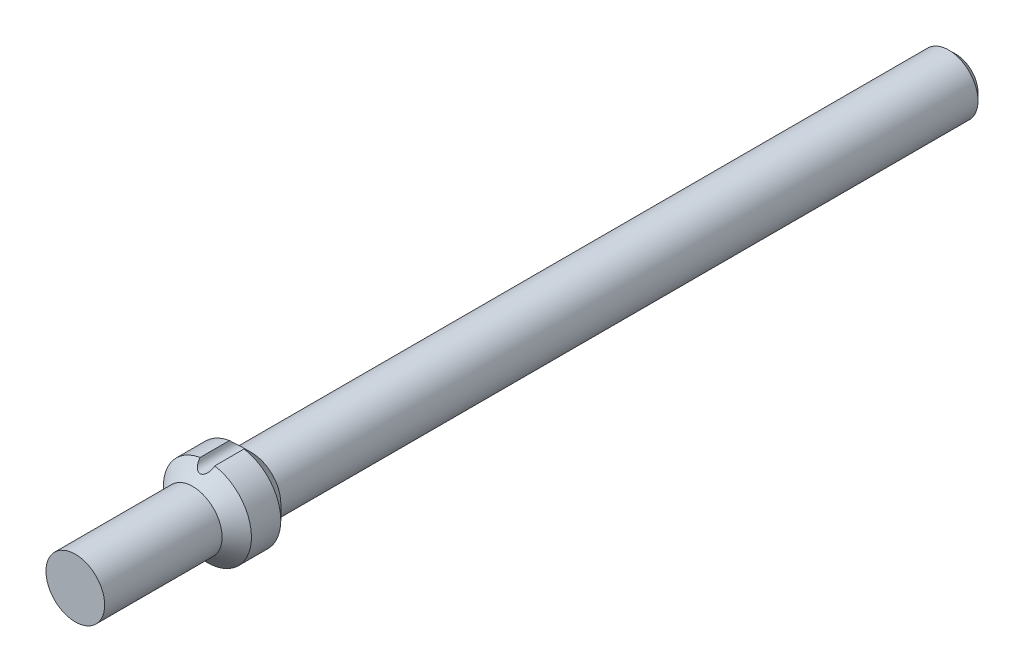
ISO-10303-21;
HEADER;
FILE_DESCRIPTION(('STEP AP214'),'2;1');
FILE_NAME('part.step','',(''),(''),'','','');
FILE_SCHEMA(('AUTOMOTIVE_DESIGN { 1 0 10303 214 1 1 1 1 }'));
ENDSEC;
DATA;
#1=APPLICATION_CONTEXT('core data for automotive mechanical design processes');
#2=APPLICATION_PROTOCOL_DEFINITION('international standard','automotive_design',2000,#1);
#3=PRODUCT_CONTEXT('',#1,'mechanical');
#4=PRODUCT('Part','Part','',(#3));
#5=PRODUCT_RELATED_PRODUCT_CATEGORY('part','',(#4));
#6=PRODUCT_DEFINITION_FORMATION('','',#4);
#7=PRODUCT_DEFINITION_CONTEXT('part definition',#1,'design');
#8=PRODUCT_DEFINITION('design','',#6,#7);
#9=PRODUCT_DEFINITION_SHAPE('','',#8);
#10=(LENGTH_UNIT() NAMED_UNIT(*) SI_UNIT(.MILLI.,.METRE.));
#11=(NAMED_UNIT(*) PLANE_ANGLE_UNIT() SI_UNIT($,.RADIAN.));
#12=(NAMED_UNIT(*) SI_UNIT($,.STERADIAN.) SOLID_ANGLE_UNIT());
#13=UNCERTAINTY_MEASURE_WITH_UNIT(LENGTH_MEASURE(1.E-05),#10,'distance_accuracy_value','');
#14=(GEOMETRIC_REPRESENTATION_CONTEXT(3) GLOBAL_UNCERTAINTY_ASSIGNED_CONTEXT((#13)) GLOBAL_UNIT_ASSIGNED_CONTEXT((#10,
#11,#12)) REPRESENTATION_CONTEXT('',''));
#15=CARTESIAN_POINT('',(0.,0.,0.));
#16=DIRECTION('',(0.,0.,1.));
#17=DIRECTION('',(1.,0.,0.));
#18=AXIS2_PLACEMENT_3D('',#15,#16,#17);
#19=CARTESIAN_POINT('',(0.,0.,190.5));
#20=DIRECTION('',(0.,0.,1.));
#21=DIRECTION('',(1.,0.,0.));
#22=AXIS2_PLACEMENT_3D('',#19,#20,#21);
#23=PLANE('',#22);
#24=CARTESIAN_POINT('',(0.,0.,190.5));
#25=DIRECTION('',(0.,0.,1.));
#26=DIRECTION('',(1.,0.,0.));
#27=AXIS2_PLACEMENT_3D('',#24,#25,#26);
#28=CIRCLE('',#27,12.7);
#29=CARTESIAN_POINT('',(12.7,0.,190.5));
#30=VERTEX_POINT('',#29);
#31=EDGE_CURVE('E45',#30,#30,#28,.T.);
#32=ORIENTED_EDGE('',*,*,#31,.T.);
#33=EDGE_LOOP('',(#32));
#34=FACE_BOUND('',#33,.T.);
#35=ADVANCED_FACE('F33',(#34),#23,.T.);
#36=CARTESIAN_POINT('',(0.,0.,190.5));
#37=DIRECTION('',(0.,0.,1.));
#38=DIRECTION('',(1.,0.,0.));
#39=AXIS2_PLACEMENT_3D('',#36,#37,#38);
#40=CYLINDRICAL_SURFACE('',#39,12.7);
#41=CARTESIAN_POINT('',(0.,0.,139.7));
#42=DIRECTION('',(0.,0.,1.));
#43=DIRECTION('',(1.,0.,0.));
#44=AXIS2_PLACEMENT_3D('',#41,#42,#43);
#45=CIRCLE('',#44,12.7);
#46=CARTESIAN_POINT('',(12.7,0.,139.7));
#47=VERTEX_POINT('',#46);
#48=EDGE_CURVE('E78',#47,#47,#45,.T.);
#49=ORIENTED_EDGE('',*,*,#48,.T.);
#50=EDGE_LOOP('',(#49));
#51=FACE_BOUND('',#50,.T.);
#52=ORIENTED_EDGE('',*,*,#31,.F.);
#53=EDGE_LOOP('',(#52));
#54=FACE_BOUND('',#53,.T.);
#55=ADVANCED_FACE('F90',(#51,#54),#40,.T.);
#56=CARTESIAN_POINT('',(0.,0.,139.7));
#57=DIRECTION('',(0.,0.,-1.));
#58=DIRECTION('',(-1.,0.,0.));
#59=AXIS2_PLACEMENT_3D('',#56,#57,#58);
#60=CONICAL_SURFACE('',#59,12.7,0.785398163397451);
#61=CARTESIAN_POINT('',(-3.16397320684149,18.7856166677167,133.3498));
#62=CARTESIAN_POINT('',(-3.15362841576084,18.6622783694114,133.473125277718));
#63=CARTESIAN_POINT('',(-3.13617180969332,18.5398462577629,133.596765176599));
#64=CARTESIAN_POINT('',(-3.08702145950594,18.2974717884602,133.84395037006));
#65=CARTESIAN_POINT('',(-3.0553105890041,18.1775326079449,133.967495371225));
#66=CARTESIAN_POINT('',(-2.97725815191958,17.9398893464153,134.214748623002));
#67=CARTESIAN_POINT('',(-2.93076740058799,17.8222216373548,134.33844513021));
#68=CARTESIAN_POINT('',(-2.82303820572173,17.5914758759735,134.583480082736));
#69=CARTESIAN_POINT('',(-2.76180883776136,17.4783950490735,134.704819929712));
#70=CARTESIAN_POINT('',(-2.59842320650613,17.2167915412879,134.988377326828));
#71=CARTESIAN_POINT('',(-2.4895095997699,17.0706722279691,135.149071604418));
#72=CARTESIAN_POINT('',(-2.30317028456942,16.8626158885982,135.380898730797));
#73=CARTESIAN_POINT('',(-2.23732435111494,16.7951938899621,135.45655105798));
#74=CARTESIAN_POINT('',(-2.09756964863938,16.66463434473,135.60398523122));
#75=CARTESIAN_POINT('',(-2.02366378944221,16.6014952651643,135.67576846022));
#76=CARTESIAN_POINT('',(-1.83674996150099,16.4565589370775,135.841549097078));
#77=CARTESIAN_POINT('',(-1.71976604721775,16.3771423745608,135.933232264957));
#78=CARTESIAN_POINT('',(-1.46872714450938,16.2314086969568,136.102700654801));
#79=CARTESIAN_POINT('',(-1.33469549432503,16.165073983746,136.180504533988));
#80=CARTESIAN_POINT('',(-1.08221240007173,16.062766098244,136.301170420252));
#81=CARTESIAN_POINT('',(-0.967070064671861,16.0233194684335,136.347955448235));
#82=CARTESIAN_POINT('',(-0.728290689593079,15.9571828409747,136.426636264636));
#83=CARTESIAN_POINT('',(-0.604661349958688,15.930481450372,136.458545350044));
#84=CARTESIAN_POINT('',(-0.350802239237976,15.8918127686385,136.504819779451));
#85=CARTESIAN_POINT('',(-0.220528820417465,15.879961011551,136.51904755131));
#86=CARTESIAN_POINT('',(0.0411321966811735,15.872573599013,136.527911061836));
#87=CARTESIAN_POINT('',(0.17251932222071,15.8770313357765,136.522554734994));
#88=CARTESIAN_POINT('',(0.416348024454796,15.9003145820964,136.494646947996));
#89=CARTESIAN_POINT('',(0.529210311313943,15.9174014959229,136.474176504411));
#90=CARTESIAN_POINT('',(0.749399712760925,15.9626582774062,136.42013349011));
#91=CARTESIAN_POINT('',(0.856724180410162,15.9908333904436,136.386554718433));
#92=CARTESIAN_POINT('',(1.10355527437647,16.0691744961836,136.293586922755));
#93=CARTESIAN_POINT('',(1.23982725531292,16.1236281277085,136.229238992238));
#94=CARTESIAN_POINT('',(1.49706867313834,16.2464590386126,136.085177402512));
#95=CARTESIAN_POINT('',(1.61800515070064,16.3148655098767,136.005431547011));
#96=CARTESIAN_POINT('',(1.89594346752594,16.4956723523005,135.796434095507));
#97=CARTESIAN_POINT('',(2.04453661309622,16.6139816582858,135.661099051541));
#98=CARTESIAN_POINT('',(2.24499521275209,16.8029845864911,135.447802092503));
#99=CARTESIAN_POINT('',(2.30815650129856,16.8680183442118,135.374866495132));
#100=CARTESIAN_POINT('',(2.42733122710855,17.0014195209502,135.226249526947));
#101=CARTESIAN_POINT('',(2.48334634905286,17.0697861489847,135.150568808708));
#102=CARTESIAN_POINT('',(2.60984444246093,17.2376989695623,134.965950578604));
#103=CARTESIAN_POINT('',(2.67697544606644,17.3386405833222,134.855978995291));
#104=CARTESIAN_POINT('',(2.79825010277812,17.5450874761338,134.633221266065));
#105=CARTESIAN_POINT('',(2.85238734092037,17.650594979131,134.520433760154));
#106=CARTESIAN_POINT('',(2.9957775631146,17.9724695342846,134.179669651793));
#107=CARTESIAN_POINT('',(3.06631334359292,18.1946046621256,133.948832872652));
#108=CARTESIAN_POINT('',(3.12424198725933,18.4812203683463,133.656561955469));
#109=CARTESIAN_POINT('',(3.13466704601658,18.5417995021738,133.595093884753));
#110=CARTESIAN_POINT('',(3.15196863515888,18.6633754626354,133.472336199684));
#111=CARTESIAN_POINT('',(3.15885276382486,18.7243711078847,133.411046486208));
#112=CARTESIAN_POINT('',(3.16397320684147,18.7856166677166,133.3498));
#113=B_SPLINE_CURVE_WITH_KNOTS('',3,(#61,#62,#63,#64,#65,#66,#67,#68,#69,#70,#71,#72,#73,#74,
#75,#76,#77,#78,#79,#80,#81,#82,#83,#84,#85,#86,#87,#88,#89,#90,#91,#92,#93,#94,#95,#96,#97,#98,
#99,#100,#101,#102,#103,#104,#105,#106,#107,#108,#109,#110,#111,#112),.UNSPECIFIED.,.F.,.F.,(4,
2,2,2,2,2,2,2,2,2,2,2,2,2,2,2,2,2,2,2,2,2,2,2,2,4),(0.,0.524026774253611,1.04868485229632,
1.57881647568533,2.1086224921059,2.83485240649359,3.19707481068595,3.55916687423703,
4.06311075395359,4.56637201722548,4.95607048254869,5.34541994146088,5.73778020190183,
6.12998151532194,6.47638322568381,6.82294900210861,7.30097230933135,7.78000618039217,
8.47557925636183,8.82444718899278,9.17323272479514,9.66354200677281,10.1540928566231,
11.1331478923163,11.393906532042,11.6541032654407),.UNSPECIFIED.);
#114=CARTESIAN_POINT('',(-3.16395648827892,18.7854166666667,133.35));
#115=VERTEX_POINT('',#114);
#116=CARTESIAN_POINT('',(3.1639564882789,18.7854166666667,133.35));
#117=VERTEX_POINT('',#116);
#118=EDGE_CURVE('E72',#115,#117,#113,.T.);
#119=ORIENTED_EDGE('',*,*,#118,.F.);
#120=CARTESIAN_POINT('',(0.,0.,133.35));
#121=DIRECTION('',(0.,0.,1.));
#122=DIRECTION('',(1.,0.,0.));
#123=AXIS2_PLACEMENT_3D('',#120,#121,#122);
#124=CIRCLE('',#123,19.05);
#125=EDGE_CURVE('E70',#115,#117,#124,.T.);
#126=ORIENTED_EDGE('',*,*,#125,.T.);
#127=EDGE_LOOP('',(#119,#126));
#128=FACE_BOUND('',#127,.T.);
#129=ORIENTED_EDGE('',*,*,#48,.F.);
#130=EDGE_LOOP('',(#129));
#131=FACE_BOUND('',#130,.T.);
#132=ADVANCED_FACE('F92',(#128,#131),#60,.T.);
#133=CARTESIAN_POINT('',(0.,0.,190.5));
#134=DIRECTION('',(0.,0.,1.));
#135=DIRECTION('',(1.,0.,0.));
#136=AXIS2_PLACEMENT_3D('',#133,#134,#135);
#137=CYLINDRICAL_SURFACE('',#136,19.05);
#138=DIRECTION('',(0.,0.,1.));
#139=VECTOR('',#138,1.);
#140=CARTESIAN_POINT('',(-3.16395648827892,18.7854166666667,153.763112725722));
#141=LINE('',#140,#139);
#142=CARTESIAN_POINT('',(-3.16395648827892,18.7854166666667,120.65));
#143=VERTEX_POINT('',#142);
#144=EDGE_CURVE('E56',#143,#115,#141,.T.);
#145=ORIENTED_EDGE('',*,*,#144,.F.);
#146=CARTESIAN_POINT('',(0.,0.,120.65));
#147=DIRECTION('',(0.,0.,1.));
#148=DIRECTION('',(1.,0.,0.));
#149=AXIS2_PLACEMENT_3D('',#146,#147,#148);
#150=CIRCLE('',#149,19.05);
#151=CARTESIAN_POINT('',(3.1639564882789,18.7854166666667,120.65));
#152=VERTEX_POINT('',#151);
#153=EDGE_CURVE('E68',#143,#152,#150,.T.);
#154=ORIENTED_EDGE('',*,*,#153,.T.);
#155=DIRECTION('',(0.,0.,1.));
#156=VECTOR('',#155,1.);
#157=CARTESIAN_POINT('',(3.1639564882789,18.7854166666667,153.763112725722));
#158=LINE('',#157,#156);
#159=EDGE_CURVE('E51',#117,#152,#158,.F.);
#160=ORIENTED_EDGE('',*,*,#159,.F.);
#161=ORIENTED_EDGE('',*,*,#125,.F.);
#162=EDGE_LOOP('',(#145,#154,#160,#161));
#163=FACE_BOUND('',#162,.T.);
#164=ADVANCED_FACE('F67',(#163),#137,.T.);
#165=CARTESIAN_POINT('',(0.,0.,120.65));
#166=DIRECTION('',(0.,0.,1.));
#167=DIRECTION('',(1.,0.,0.));
#168=AXIS2_PLACEMENT_3D('',#165,#166,#167);
#169=CONICAL_SURFACE('',#168,19.05,0.785398163397453);
#170=CARTESIAN_POINT('',(3.16397320684147,18.7856166677167,120.6502));
#171=CARTESIAN_POINT('',(3.15362841576082,18.6622783694114,120.526874722282));
#172=CARTESIAN_POINT('',(3.1361718096933,18.5398462577629,120.403234823401));
#173=CARTESIAN_POINT('',(3.08702145950592,18.2974717884602,120.15604962994));
#174=CARTESIAN_POINT('',(3.05531058900408,18.177532607945,120.032504628775));
#175=CARTESIAN_POINT('',(2.97725815191956,17.9398893464153,119.785251376998));
#176=CARTESIAN_POINT('',(2.93076740058797,17.8222216373548,119.66155486979));
#177=CARTESIAN_POINT('',(2.82303820572171,17.5914758759735,119.416519917264));
#178=CARTESIAN_POINT('',(2.76180883776135,17.4783950490735,119.295180070288));
#179=CARTESIAN_POINT('',(2.59842320650611,17.2167915412879,119.011622673172));
#180=CARTESIAN_POINT('',(2.48950959976989,17.0706722279691,118.850928395582));
#181=CARTESIAN_POINT('',(2.3031702845694,16.8626158885982,118.619101269203));
#182=CARTESIAN_POINT('',(2.23732435111492,16.7951938899621,118.54344894202));
#183=CARTESIAN_POINT('',(2.09756964863936,16.66463434473,118.39601476878));
#184=CARTESIAN_POINT('',(2.02366378944219,16.6014952651643,118.32423153978));
#185=CARTESIAN_POINT('',(1.83674996150098,16.4565589370775,118.158450902922));
#186=CARTESIAN_POINT('',(1.71976604721773,16.3771423745608,118.066767735043));
#187=CARTESIAN_POINT('',(1.46872714450936,16.2314086969568,117.897299345199));
#188=CARTESIAN_POINT('',(1.33469549432502,16.165073983746,117.819495466012));
#189=CARTESIAN_POINT('',(1.08221240007172,16.062766098244,117.698829579748));
#190=CARTESIAN_POINT('',(0.967070064671844,16.0233194684335,117.652044551765));
#191=CARTESIAN_POINT('',(0.728290689593058,15.9571828409747,117.573363735364));
#192=CARTESIAN_POINT('',(0.604661349958668,15.930481450372,117.541454649957));
#193=CARTESIAN_POINT('',(0.350802239237959,15.8918127686385,117.495180220549));
#194=CARTESIAN_POINT('',(0.220528820417448,15.879961011551,117.48095244869));
#195=CARTESIAN_POINT('',(-0.0411321966811902,15.872573599013,117.472088938164));
#196=CARTESIAN_POINT('',(-0.172519322220726,15.8770313357765,117.477445265006));
#197=CARTESIAN_POINT('',(-0.416348024454816,15.9003145820964,117.505353052004));
#198=CARTESIAN_POINT('',(-0.529210311313966,15.9174014959229,117.525823495589));
#199=CARTESIAN_POINT('',(-0.74939971276095,15.9626582774062,117.57986650989));
#200=CARTESIAN_POINT('',(-0.856724180410184,15.9908333904436,117.613445281567));
#201=CARTESIAN_POINT('',(-1.10355527437649,16.0691744961836,117.706413077245));
#202=CARTESIAN_POINT('',(-1.23982725531294,16.1236281277085,117.770761007762));
#203=CARTESIAN_POINT('',(-1.49706867313836,16.2464590386126,117.914822597488));
#204=CARTESIAN_POINT('',(-1.61800515070066,16.3148655098767,117.994568452989));
#205=CARTESIAN_POINT('',(-1.89594346752596,16.4956723523005,118.203565904493));
#206=CARTESIAN_POINT('',(-2.04453661309623,16.6139816582858,118.338900948459));
#207=CARTESIAN_POINT('',(-2.24499521275211,16.8029845864911,118.552197907497));
#208=CARTESIAN_POINT('',(-2.30815650129858,16.8680183442118,118.625133504868));
#209=CARTESIAN_POINT('',(-2.42733122710856,17.0014195209502,118.773750473053));
#210=CARTESIAN_POINT('',(-2.48334634905287,17.0697861489847,118.849431191292));
#211=CARTESIAN_POINT('',(-2.60984444246095,17.2376989695623,119.034049421396));
#212=CARTESIAN_POINT('',(-2.67697544606647,17.3386405833222,119.144021004709));
#213=CARTESIAN_POINT('',(-2.79825010277814,17.5450874761338,119.366778733935));
#214=CARTESIAN_POINT('',(-2.85238734092039,17.650594979131,119.479566239846));
#215=CARTESIAN_POINT('',(-2.99577756311461,17.9724695342846,119.820330348208));
#216=CARTESIAN_POINT('',(-3.06631334359294,18.1946046621255,120.051167127348));
#217=CARTESIAN_POINT('',(-3.12424198725935,18.4812203683463,120.343438044531));
#218=CARTESIAN_POINT('',(-3.1346670460166,18.5417995021738,120.404906115247));
#219=CARTESIAN_POINT('',(-3.1519686351589,18.6633754626353,120.527663800316));
#220=CARTESIAN_POINT('',(-3.15885276382488,18.7243711078847,120.588953513792));
#221=CARTESIAN_POINT('',(-3.16397320684149,18.7856166677167,120.6502));
#222=B_SPLINE_CURVE_WITH_KNOTS('',3,(#170,#171,#172,#173,#174,#175,#176,#177,#178,#179,#180,
#181,#182,#183,#184,#185,#186,#187,#188,#189,#190,#191,#192,#193,#194,#195,#196,#197,#198,#199,
#200,#201,#202,#203,#204,#205,#206,#207,#208,#209,#210,#211,#212,#213,#214,#215,#216,#217,#218,
#219,#220,#221),.UNSPECIFIED.,.F.,.F.,(4,2,2,2,2,2,2,2,2,2,2,2,2,2,2,2,2,2,2,2,2,2,2,2,2,4),(0.,
0.524026774253591,1.0486848522963,1.57881647568532,2.10862249210586,2.83485240649356,
3.19707481068595,3.55916687423701,4.06311075395358,4.56637201722545,4.95607048254868,
5.34541994146087,5.73778020190181,6.12998151532192,6.4763832256838,6.82294900210858,
7.30097230933134,7.78000618039215,8.4755792563618,8.82444718899276,9.17323272479511,
9.6635420067728,10.1540928566231,11.1331478923163,11.3939065320419,11.6541032654407),.UNSPECIFIED.);
#223=EDGE_CURVE('E11',#152,#143,#222,.T.);
#224=ORIENTED_EDGE('',*,*,#223,.F.);
#225=ORIENTED_EDGE('',*,*,#153,.F.);
#226=EDGE_LOOP('',(#224,#225));
#227=FACE_BOUND('',#226,.T.);
#228=CARTESIAN_POINT('',(0.,0.,114.3));
#229=DIRECTION('',(0.,0.,1.));
#230=DIRECTION('',(1.,0.,0.));
#231=AXIS2_PLACEMENT_3D('',#228,#229,#230);
#232=CIRCLE('',#231,12.7);
#233=CARTESIAN_POINT('',(12.7,0.,114.3));
#234=VERTEX_POINT('',#233);
#235=EDGE_CURVE('E76',#234,#234,#232,.T.);
#236=ORIENTED_EDGE('',*,*,#235,.T.);
#237=EDGE_LOOP('',(#236));
#238=FACE_BOUND('',#237,.T.);
#239=ADVANCED_FACE('F74',(#227,#238),#169,.T.);
#240=CARTESIAN_POINT('',(0.,0.,190.5));
#241=DIRECTION('',(0.,0.,1.));
#242=DIRECTION('',(1.,0.,0.));
#243=AXIS2_PLACEMENT_3D('',#240,#241,#242);
#244=CYLINDRICAL_SURFACE('',#243,12.7);
#245=CARTESIAN_POINT('',(0.,0.,-187.325));
#246=DIRECTION('',(0.,0.,1.));
#247=DIRECTION('',(1.,0.,0.));
#248=AXIS2_PLACEMENT_3D('',#245,#246,#247);
#249=CIRCLE('',#248,12.7000000000001);
#250=CARTESIAN_POINT('',(12.7,0.,-187.325));
#251=VERTEX_POINT('',#250);
#252=EDGE_CURVE('E81',#251,#251,#249,.T.);
#253=ORIENTED_EDGE('',*,*,#252,.T.);
#254=EDGE_LOOP('',(#253));
#255=FACE_BOUND('',#254,.T.);
#256=ORIENTED_EDGE('',*,*,#235,.F.);
#257=EDGE_LOOP('',(#256));
#258=FACE_BOUND('',#257,.T.);
#259=ADVANCED_FACE('F119',(#255,#258),#244,.T.);
#260=CARTESIAN_POINT('',(0.,0.,-187.325));
#261=DIRECTION('',(0.,0.,1.));
#262=DIRECTION('',(1.,0.,0.));
#263=AXIS2_PLACEMENT_3D('',#260,#261,#262);
#264=CONICAL_SURFACE('',#263,12.7000000000001,0.785398163397453);
#265=CARTESIAN_POINT('',(0.,0.,-190.5));
#266=DIRECTION('',(0.,0.,1.));
#267=DIRECTION('',(1.,0.,0.));
#268=AXIS2_PLACEMENT_3D('',#265,#266,#267);
#269=CIRCLE('',#268,9.525);
#270=CARTESIAN_POINT('',(9.52499999999993,0.,-190.5));
#271=VERTEX_POINT('',#270);
#272=EDGE_CURVE('E71',#271,#271,#269,.T.);
#273=ORIENTED_EDGE('',*,*,#272,.T.);
#274=EDGE_LOOP('',(#273));
#275=FACE_BOUND('',#274,.T.);
#276=ORIENTED_EDGE('',*,*,#252,.F.);
#277=EDGE_LOOP('',(#276));
#278=FACE_BOUND('',#277,.T.);
#279=ADVANCED_FACE('F115',(#275,#278),#264,.T.);
#280=CARTESIAN_POINT('',(9.52499999999993,0.,-190.5));
#281=DIRECTION('',(0.,0.,-1.));
#282=DIRECTION('',(-1.,0.,0.));
#283=AXIS2_PLACEMENT_3D('',#280,#281,#282);
#284=PLANE('',#283);
#285=ORIENTED_EDGE('',*,*,#272,.F.);
#286=EDGE_LOOP('',(#285));
#287=FACE_BOUND('',#286,.T.);
#288=ADVANCED_FACE('F111',(#287),#284,.T.);
#289=CARTESIAN_POINT('',(0.,19.05,-190.501));
#290=DIRECTION('',(0.,0.,1.));
#291=DIRECTION('',(1.,0.,0.));
#292=AXIS2_PLACEMENT_3D('',#289,#290,#291);
#293=CYLINDRICAL_SURFACE('',#292,3.175);
#294=ORIENTED_EDGE('',*,*,#144,.T.);
#295=ORIENTED_EDGE('',*,*,#118,.T.);
#296=ORIENTED_EDGE('',*,*,#159,.T.);
#297=ORIENTED_EDGE('',*,*,#223,.T.);
#298=EDGE_LOOP('',(#294,#295,#296,#297));
#299=FACE_BOUND('',#298,.T.);
#300=ADVANCED_FACE('F61',(#299),#293,.F.);
#301=CLOSED_SHELL('',(#35,#55,#132,#164,#239,#259,#279,#288,#300));
#302=MANIFOLD_SOLID_BREP('B2',#301);
#303=ADVANCED_BREP_SHAPE_REPRESENTATION('',(#18,#302),#14);
#304=SHAPE_DEFINITION_REPRESENTATION(#9,#303);
ENDSEC;
END-ISO-10303-21;
